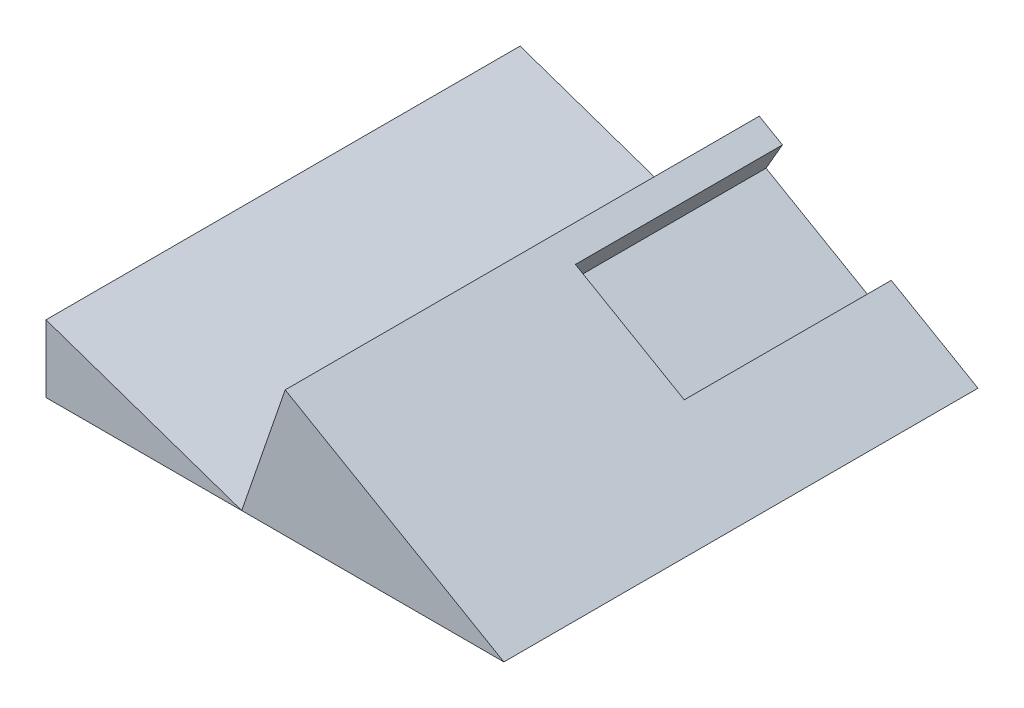
ISO-10303-21;
HEADER;
FILE_DESCRIPTION(('STEP AP214'),'2;1');
FILE_NAME('part.step','',(''),(''),'','','');
FILE_SCHEMA(('AUTOMOTIVE_DESIGN { 1 0 10303 214 1 1 1 1 }'));
ENDSEC;
DATA;
#1=APPLICATION_CONTEXT('core data for automotive mechanical design processes');
#2=APPLICATION_PROTOCOL_DEFINITION('international standard','automotive_design',2000,#1);
#3=PRODUCT_CONTEXT('',#1,'mechanical');
#4=PRODUCT('Part','Part','',(#3));
#5=PRODUCT_RELATED_PRODUCT_CATEGORY('part','',(#4));
#6=PRODUCT_DEFINITION_FORMATION('','',#4);
#7=PRODUCT_DEFINITION_CONTEXT('part definition',#1,'design');
#8=PRODUCT_DEFINITION('design','',#6,#7);
#9=PRODUCT_DEFINITION_SHAPE('','',#8);
#10=(LENGTH_UNIT() NAMED_UNIT(*) SI_UNIT(.MILLI.,.METRE.));
#11=(NAMED_UNIT(*) PLANE_ANGLE_UNIT() SI_UNIT($,.RADIAN.));
#12=(NAMED_UNIT(*) SI_UNIT($,.STERADIAN.) SOLID_ANGLE_UNIT());
#13=UNCERTAINTY_MEASURE_WITH_UNIT(LENGTH_MEASURE(1.E-05),#10,'distance_accuracy_value','');
#14=(GEOMETRIC_REPRESENTATION_CONTEXT(3) GLOBAL_UNCERTAINTY_ASSIGNED_CONTEXT((#13)) GLOBAL_UNIT_ASSIGNED_CONTEXT((#10,
#11,#12)) REPRESENTATION_CONTEXT('',''));
#15=CARTESIAN_POINT('',(0.,0.,0.));
#16=DIRECTION('',(0.,0.,1.));
#17=DIRECTION('',(1.,0.,0.));
#18=AXIS2_PLACEMENT_3D('',#15,#16,#17);
#19=CARTESIAN_POINT('',(19.423515405221,0.,-19.5));
#20=DIRECTION('',(0.,0.,1.));
#21=DIRECTION('',(1.,0.,0.));
#22=AXIS2_PLACEMENT_3D('',#19,#20,#21);
#23=PLANE('',#22);
#24=DIRECTION('',(0.866025403784438,-0.500000000000001,0.));
#25=VECTOR('',#24,1.);
#26=CARTESIAN_POINT('',(4.61602540378445,7.9951905283833,-19.5));
#27=LINE('',#26,#25);
#28=CARTESIAN_POINT('',(2.00961894323343,9.50000000000002,-19.5));
#29=VERTEX_POINT('',#28);
#30=CARTESIAN_POINT('',(15.,2.,-19.5));
#31=VERTEX_POINT('',#30);
#32=EDGE_CURVE('E115',#29,#31,#27,.T.);
#33=ORIENTED_EDGE('',*,*,#32,.T.);
#34=DIRECTION('',(-1.,0.,0.));
#35=VECTOR('',#34,1.);
#36=CARTESIAN_POINT('',(-73.3630592995996,2.,-19.5));
#37=LINE('',#36,#35);
#38=CARTESIAN_POINT('',(-24.2640880698669,2.,-19.5));
#39=VERTEX_POINT('',#38);
#40=EDGE_CURVE('E109',#31,#39,#37,.T.);
#41=ORIENTED_EDGE('',*,*,#40,.T.);
#42=DIRECTION('',(0.325444401146469,0.945561178222973,0.));
#43=VECTOR('',#42,1.);
#44=CARTESIAN_POINT('',(-22.3096352157414,7.67855749559022,-19.5));
#45=LINE('',#44,#43);
#46=CARTESIAN_POINT('',(-17.7552000469375,20.9112235644595,-19.5));
#47=VERTEX_POINT('',#46);
#48=EDGE_CURVE('E114',#39,#47,#45,.T.);
#49=ORIENTED_EDGE('',*,*,#48,.T.);
#50=CARTESIAN_POINT('',(-14.2910984317997,18.9112235644595,-19.5));
#51=VERTEX_POINT('',#50);
#52=EDGE_CURVE('E124',#47,#51,#27,.T.);
#53=ORIENTED_EDGE('',*,*,#52,.T.);
#54=DIRECTION('',(0.500000000000001,0.866025403784438,0.));
#55=VECTOR('',#54,1.);
#56=CARTESIAN_POINT('',(-16.7392952317479,14.6708223200218,-19.5));
#57=LINE('',#56,#55);
#58=CARTESIAN_POINT('',(-16.7392952317479,14.6708223200218,-19.5));
#59=VERTEX_POINT('',#58);
#60=EDGE_CURVE('E156',#59,#51,#57,.T.);
#61=ORIENTED_EDGE('',*,*,#60,.F.);
#62=DIRECTION('',(-0.866025403784438,0.500000000000001,0.));
#63=VECTOR('',#62,1.);
#64=CARTESIAN_POINT('',(2.16782860383635,3.75478928394566,-19.5));
#65=LINE('',#64,#63);
#66=CARTESIAN_POINT('',(-0.438577856714673,5.25959875556237,-19.5));
#67=VERTEX_POINT('',#66);
#68=EDGE_CURVE('E151',#67,#59,#65,.T.);
#69=ORIENTED_EDGE('',*,*,#68,.F.);
#70=DIRECTION('',(-0.500000000000001,-0.866025403784438,0.));
#71=VECTOR('',#70,1.);
#72=CARTESIAN_POINT('',(-0.438577856714673,5.25959875556237,-19.5));
#73=LINE('',#72,#71);
#74=EDGE_CURVE('E119',#29,#67,#73,.T.);
#75=ORIENTED_EDGE('',*,*,#74,.F.);
#76=EDGE_LOOP('',(#33,#41,#49,#53,#61,#69,#75));
#77=FACE_BOUND('',#76,.T.);
#78=ADVANCED_FACE('F53',(#77),#23,.F.);
#79=CARTESIAN_POINT('',(15.,2.,51.5));
#80=DIRECTION('',(0.,0.,-1.));
#81=DIRECTION('',(-1.,0.,0.));
#82=AXIS2_PLACEMENT_3D('',#79,#80,#81);
#83=PLANE('',#82);
#84=DIRECTION('',(-0.325444401146469,-0.945561178222973,0.));
#85=VECTOR('',#84,1.);
#86=CARTESIAN_POINT('',(-22.3096352157414,7.67855749559022,51.5));
#87=LINE('',#86,#85);
#88=CARTESIAN_POINT('',(-17.7552000469375,20.9112235644595,51.5));
#89=VERTEX_POINT('',#88);
#90=CARTESIAN_POINT('',(-24.2640880698669,2.,51.5));
#91=VERTEX_POINT('',#90);
#92=EDGE_CURVE('E138',#89,#91,#87,.T.);
#93=ORIENTED_EDGE('',*,*,#92,.T.);
#94=DIRECTION('',(1.,0.,0.));
#95=VECTOR('',#94,1.);
#96=CARTESIAN_POINT('',(15.,2.,51.5));
#97=LINE('',#96,#95);
#98=CARTESIAN_POINT('',(15.,2.,51.5));
#99=VERTEX_POINT('',#98);
#100=EDGE_CURVE('E57',#91,#99,#97,.T.);
#101=ORIENTED_EDGE('',*,*,#100,.T.);
#102=DIRECTION('',(-0.866025403784438,0.500000000000001,0.));
#103=VECTOR('',#102,1.);
#104=CARTESIAN_POINT('',(4.61602540378445,7.9951905283833,51.5));
#105=LINE('',#104,#103);
#106=EDGE_CURVE('E129',#99,#89,#105,.T.);
#107=ORIENTED_EDGE('',*,*,#106,.T.);
#108=EDGE_LOOP('',(#93,#101,#107));
#109=FACE_BOUND('',#108,.T.);
#110=ADVANCED_FACE('F180',(#109),#83,.F.);
#111=CARTESIAN_POINT('',(4.61602540378445,7.9951905283833,-51.5));
#112=DIRECTION('',(0.500000000000001,0.866025403784438,0.));
#113=DIRECTION('',(-0.866025403784438,0.500000000000001,0.));
#114=AXIS2_PLACEMENT_3D('',#111,#112,#113);
#115=PLANE('',#114);
#116=ORIENTED_EDGE('',*,*,#52,.F.);
#117=DIRECTION('',(0.,0.,1.));
#118=VECTOR('',#117,1.);
#119=CARTESIAN_POINT('',(-17.7552000469375,20.9112235644595,-51.5));
#120=LINE('',#119,#118);
#121=EDGE_CURVE('E130',#47,#89,#120,.T.);
#122=ORIENTED_EDGE('',*,*,#121,.T.);
#123=ORIENTED_EDGE('',*,*,#106,.F.);
#124=DIRECTION('',(0.,0.,-1.));
#125=VECTOR('',#124,1.);
#126=CARTESIAN_POINT('',(15.,2.,51.5));
#127=LINE('',#126,#125);
#128=EDGE_CURVE('E112',#99,#31,#127,.T.);
#129=ORIENTED_EDGE('',*,*,#128,.T.);
#130=ORIENTED_EDGE('',*,*,#32,.F.);
#131=DIRECTION('',(0.,0.,-1.));
#132=VECTOR('',#131,1.);
#133=CARTESIAN_POINT('',(2.00961894323343,9.50000000000002,-58.5));
#134=LINE('',#133,#132);
#135=CARTESIAN_POINT('',(2.00961894323344,9.50000000000001,11.5));
#136=VERTEX_POINT('',#135);
#137=EDGE_CURVE('E145',#136,#29,#134,.T.);
#138=ORIENTED_EDGE('',*,*,#137,.F.);
#139=DIRECTION('',(0.866025403784438,-0.500000000000001,0.));
#140=VECTOR('',#139,1.);
#141=CARTESIAN_POINT('',(2.00961894323344,9.50000000000001,11.5));
#142=LINE('',#141,#140);
#143=CARTESIAN_POINT('',(-14.2910984317998,18.9112235644595,11.5));
#144=VERTEX_POINT('',#143);
#145=EDGE_CURVE('E63',#144,#136,#142,.T.);
#146=ORIENTED_EDGE('',*,*,#145,.F.);
#147=DIRECTION('',(0.,0.,1.));
#148=VECTOR('',#147,1.);
#149=CARTESIAN_POINT('',(-14.2910984317998,18.9112235644595,-51.5));
#150=LINE('',#149,#148);
#151=EDGE_CURVE('E135',#51,#144,#150,.T.);
#152=ORIENTED_EDGE('',*,*,#151,.F.);
#153=EDGE_LOOP('',(#116,#122,#123,#129,#130,#138,#146,#152));
#154=FACE_BOUND('',#153,.T.);
#155=ADVANCED_FACE('F127',(#154),#115,.T.);
#156=CARTESIAN_POINT('',(-22.3096352157414,7.67855749559022,-51.5));
#157=DIRECTION('',(-0.945561178222973,0.325444401146469,0.));
#158=DIRECTION('',(-0.325444401146469,-0.945561178222973,0.));
#159=AXIS2_PLACEMENT_3D('',#156,#157,#158);
#160=PLANE('',#159);
#161=ORIENTED_EDGE('',*,*,#48,.F.);
#162=DIRECTION('',(0.,0.,1.));
#163=VECTOR('',#162,1.);
#164=CARTESIAN_POINT('',(-24.2640880698669,2.,-51.5));
#165=LINE('',#164,#163);
#166=EDGE_CURVE('E106',#39,#91,#165,.T.);
#167=ORIENTED_EDGE('',*,*,#166,.T.);
#168=ORIENTED_EDGE('',*,*,#92,.F.);
#169=ORIENTED_EDGE('',*,*,#121,.F.);
#170=EDGE_LOOP('',(#161,#167,#168,#169));
#171=FACE_BOUND('',#170,.T.);
#172=ADVANCED_FACE('F178',(#171),#160,.T.);
#173=CARTESIAN_POINT('',(2.16782860383635,3.75478928394566,0.));
#174=DIRECTION('',(-0.500000000000001,-0.866025403784438,0.));
#175=DIRECTION('',(0.866025403784438,-0.500000000000001,0.));
#176=AXIS2_PLACEMENT_3D('',#173,#174,#175);
#177=PLANE('',#176);
#178=DIRECTION('',(0.,0.,-1.));
#179=VECTOR('',#178,1.);
#180=CARTESIAN_POINT('',(-0.438577856714677,5.25959875556237,-58.5));
#181=LINE('',#180,#179);
#182=CARTESIAN_POINT('',(-0.438577856714669,5.25959875556237,11.5));
#183=VERTEX_POINT('',#182);
#184=EDGE_CURVE('E132',#183,#67,#181,.T.);
#185=ORIENTED_EDGE('',*,*,#184,.T.);
#186=ORIENTED_EDGE('',*,*,#68,.T.);
#187=DIRECTION('',(0.,0.,1.));
#188=VECTOR('',#187,1.);
#189=CARTESIAN_POINT('',(-16.7392952317479,14.6708223200218,11.5));
#190=LINE('',#189,#188);
#191=CARTESIAN_POINT('',(-16.7392952317479,14.6708223200218,11.5));
#192=VERTEX_POINT('',#191);
#193=EDGE_CURVE('E148',#59,#192,#190,.T.);
#194=ORIENTED_EDGE('',*,*,#193,.T.);
#195=DIRECTION('',(0.866025403784438,-0.500000000000001,0.));
#196=VECTOR('',#195,1.);
#197=CARTESIAN_POINT('',(-0.438577856714669,5.25959875556237,11.5));
#198=LINE('',#197,#196);
#199=EDGE_CURVE('E150',#192,#183,#198,.T.);
#200=ORIENTED_EDGE('',*,*,#199,.T.);
#201=EDGE_LOOP('',(#185,#186,#194,#200));
#202=FACE_BOUND('',#201,.T.);
#203=ADVANCED_FACE('F163',(#202),#177,.F.);
#204=CARTESIAN_POINT('',(-16.7392952317479,14.6708223200218,11.5));
#205=DIRECTION('',(-0.866025403784438,0.500000000000001,0.));
#206=DIRECTION('',(-0.500000000000001,-0.866025403784438,0.));
#207=AXIS2_PLACEMENT_3D('',#204,#205,#206);
#208=PLANE('',#207);
#209=ORIENTED_EDGE('',*,*,#193,.F.);
#210=ORIENTED_EDGE('',*,*,#60,.T.);
#211=ORIENTED_EDGE('',*,*,#151,.T.);
#212=DIRECTION('',(0.500000000000001,0.866025403784438,0.));
#213=VECTOR('',#212,1.);
#214=CARTESIAN_POINT('',(-16.7392952317479,14.6708223200218,11.5));
#215=LINE('',#214,#213);
#216=EDGE_CURVE('E12',#192,#144,#215,.T.);
#217=ORIENTED_EDGE('',*,*,#216,.F.);
#218=EDGE_LOOP('',(#209,#210,#211,#217));
#219=FACE_BOUND('',#218,.T.);
#220=ADVANCED_FACE('F167',(#219),#208,.F.);
#221=CARTESIAN_POINT('',(-0.438577856714677,5.25959875556237,-58.5));
#222=DIRECTION('',(0.866025403784438,-0.500000000000001,0.));
#223=DIRECTION('',(0.500000000000001,0.866025403784438,0.));
#224=AXIS2_PLACEMENT_3D('',#221,#222,#223);
#225=PLANE('',#224);
#226=ORIENTED_EDGE('',*,*,#137,.T.);
#227=ORIENTED_EDGE('',*,*,#74,.T.);
#228=ORIENTED_EDGE('',*,*,#184,.F.);
#229=DIRECTION('',(0.500000000000001,0.866025403784438,0.));
#230=VECTOR('',#229,1.);
#231=CARTESIAN_POINT('',(-0.438577856714669,5.25959875556237,11.5));
#232=LINE('',#231,#230);
#233=EDGE_CURVE('E142',#183,#136,#232,.T.);
#234=ORIENTED_EDGE('',*,*,#233,.T.);
#235=EDGE_LOOP('',(#226,#227,#228,#234));
#236=FACE_BOUND('',#235,.T.);
#237=ADVANCED_FACE('F174',(#236),#225,.F.);
#238=CARTESIAN_POINT('',(-0.438577856714669,5.25959875556237,11.5));
#239=DIRECTION('',(0.,0.,1.));
#240=DIRECTION('',(1.,0.,0.));
#241=AXIS2_PLACEMENT_3D('',#238,#239,#240);
#242=PLANE('',#241);
#243=ORIENTED_EDGE('',*,*,#145,.T.);
#244=ORIENTED_EDGE('',*,*,#233,.F.);
#245=ORIENTED_EDGE('',*,*,#199,.F.);
#246=ORIENTED_EDGE('',*,*,#216,.T.);
#247=EDGE_LOOP('',(#243,#244,#245,#246));
#248=FACE_BOUND('',#247,.T.);
#249=ADVANCED_FACE('F172',(#248),#242,.F.);
#250=CARTESIAN_POINT('',(-73.3630592995996,2.,-19.5));
#251=DIRECTION('',(0.,1.,0.));
#252=DIRECTION('',(0.,0.,1.));
#253=AXIS2_PLACEMENT_3D('',#250,#251,#252);
#254=PLANE('',#253);
#255=ORIENTED_EDGE('',*,*,#166,.F.);
#256=ORIENTED_EDGE('',*,*,#40,.F.);
#257=ORIENTED_EDGE('',*,*,#128,.F.);
#258=ORIENTED_EDGE('',*,*,#100,.F.);
#259=EDGE_LOOP('',(#255,#256,#257,#258));
#260=FACE_BOUND('',#259,.T.);
#261=ADVANCED_FACE('F55',(#260),#254,.F.);
#262=CLOSED_SHELL('',(#78,#110,#155,#172,#203,#220,#237,#249,#261));
#263=MANIFOLD_SOLID_BREP('B2',#262);
#264=CARTESIAN_POINT('',(19.423515405221,0.,-19.5));
#265=DIRECTION('',(0.,0.,1.));
#266=DIRECTION('',(1.,0.,0.));
#267=AXIS2_PLACEMENT_3D('',#264,#265,#266);
#268=PLANE('',#267);
#269=DIRECTION('',(0.945561178222972,-0.325444401146469,0.));
#270=VECTOR('',#269,1.);
#271=CARTESIAN_POINT('',(-1.9544528541255,-5.67855749559023,-19.5));
#272=LINE('',#271,#270);
#273=CARTESIAN_POINT('',(-53.576484594779,12.0887764355406,-19.5));
#274=VERTEX_POINT('',#273);
#275=CARTESIAN_POINT('',(-24.2640880698669,2.,-19.5));
#276=VERTEX_POINT('',#275);
#277=EDGE_CURVE('E310',#274,#276,#272,.T.);
#278=ORIENTED_EDGE('',*,*,#277,.T.);
#279=DIRECTION('',(-1.,0.,0.));
#280=VECTOR('',#279,1.);
#281=CARTESIAN_POINT('',(19.423515405221,2.,-19.5));
#282=LINE('',#281,#280);
#283=CARTESIAN_POINT('',(-53.576484594779,2.,-19.5));
#284=VERTEX_POINT('',#283);
#285=EDGE_CURVE('E279',#276,#284,#282,.T.);
#286=ORIENTED_EDGE('',*,*,#285,.T.);
#287=DIRECTION('',(0.,1.,0.));
#288=VECTOR('',#287,1.);
#289=CARTESIAN_POINT('',(-53.576484594779,0.,-19.5));
#290=LINE('',#289,#288);
#291=EDGE_CURVE('E311',#284,#274,#290,.T.);
#292=ORIENTED_EDGE('',*,*,#291,.T.);
#293=EDGE_LOOP('',(#278,#286,#292));
#294=FACE_BOUND('',#293,.T.);
#295=ADVANCED_FACE('F275',(#294),#268,.F.);
#296=CARTESIAN_POINT('',(-1.9544528541255,-5.67855749559023,-51.5));
#297=DIRECTION('',(0.325444401146469,0.945561178222972,0.));
#298=DIRECTION('',(-0.945561178222972,0.325444401146469,0.));
#299=AXIS2_PLACEMENT_3D('',#296,#297,#298);
#300=PLANE('',#299);
#301=ORIENTED_EDGE('',*,*,#277,.F.);
#302=DIRECTION('',(0.,0.,1.));
#303=VECTOR('',#302,1.);
#304=CARTESIAN_POINT('',(-53.576484594779,12.0887764355406,-51.5));
#305=LINE('',#304,#303);
#306=CARTESIAN_POINT('',(-53.576484594779,12.0887764355406,51.5));
#307=VERTEX_POINT('',#306);
#308=EDGE_CURVE('E308',#274,#307,#305,.T.);
#309=ORIENTED_EDGE('',*,*,#308,.T.);
#310=DIRECTION('',(-0.945561178222972,0.325444401146469,0.));
#311=VECTOR('',#310,1.);
#312=CARTESIAN_POINT('',(-1.9544528541255,-5.67855749559023,51.5));
#313=LINE('',#312,#311);
#314=CARTESIAN_POINT('',(-24.2640880698669,2.,51.5));
#315=VERTEX_POINT('',#314);
#316=EDGE_CURVE('E314',#315,#307,#313,.T.);
#317=ORIENTED_EDGE('',*,*,#316,.F.);
#318=DIRECTION('',(0.,0.,1.));
#319=VECTOR('',#318,1.);
#320=CARTESIAN_POINT('',(-24.2640880698669,2.,-51.5));
#321=LINE('',#320,#319);
#322=EDGE_CURVE('E51',#276,#315,#321,.T.);
#323=ORIENTED_EDGE('',*,*,#322,.F.);
#324=EDGE_LOOP('',(#301,#309,#317,#323));
#325=FACE_BOUND('',#324,.T.);
#326=ADVANCED_FACE('F316',(#325),#300,.T.);
#327=CARTESIAN_POINT('',(-53.576484594779,0.,-51.5));
#328=DIRECTION('',(-1.,0.,0.));
#329=DIRECTION('',(0.,0.,1.));
#330=AXIS2_PLACEMENT_3D('',#327,#328,#329);
#331=PLANE('',#330);
#332=DIRECTION('',(0.,0.,-1.));
#333=VECTOR('',#332,1.);
#334=CARTESIAN_POINT('',(-53.576484594779,2.,-51.5));
#335=LINE('',#334,#333);
#336=CARTESIAN_POINT('',(-53.576484594779,2.,51.5));
#337=VERTEX_POINT('',#336);
#338=EDGE_CURVE('E293',#337,#284,#335,.T.);
#339=ORIENTED_EDGE('',*,*,#338,.F.);
#340=DIRECTION('',(0.,-1.,0.));
#341=VECTOR('',#340,1.);
#342=CARTESIAN_POINT('',(-53.576484594779,0.,51.5));
#343=LINE('',#342,#341);
#344=EDGE_CURVE('E322',#307,#337,#343,.T.);
#345=ORIENTED_EDGE('',*,*,#344,.F.);
#346=ORIENTED_EDGE('',*,*,#308,.F.);
#347=ORIENTED_EDGE('',*,*,#291,.F.);
#348=EDGE_LOOP('',(#339,#345,#346,#347));
#349=FACE_BOUND('',#348,.T.);
#350=ADVANCED_FACE('F331',(#349),#331,.T.);
#351=CARTESIAN_POINT('',(15.,2.,51.5));
#352=DIRECTION('',(0.,0.,-1.));
#353=DIRECTION('',(-1.,0.,0.));
#354=AXIS2_PLACEMENT_3D('',#351,#352,#353);
#355=PLANE('',#354);
#356=ORIENTED_EDGE('',*,*,#344,.T.);
#357=DIRECTION('',(1.,0.,0.));
#358=VECTOR('',#357,1.);
#359=CARTESIAN_POINT('',(15.,2.,51.5));
#360=LINE('',#359,#358);
#361=EDGE_CURVE('E324',#337,#315,#360,.T.);
#362=ORIENTED_EDGE('',*,*,#361,.T.);
#363=ORIENTED_EDGE('',*,*,#316,.T.);
#364=EDGE_LOOP('',(#356,#362,#363));
#365=FACE_BOUND('',#364,.T.);
#366=ADVANCED_FACE('F277',(#365),#355,.F.);
#367=CARTESIAN_POINT('',(-73.3630592995996,2.,-19.5));
#368=DIRECTION('',(0.,1.,0.));
#369=DIRECTION('',(0.,0.,1.));
#370=AXIS2_PLACEMENT_3D('',#367,#368,#369);
#371=PLANE('',#370);
#372=ORIENTED_EDGE('',*,*,#338,.T.);
#373=ORIENTED_EDGE('',*,*,#285,.F.);
#374=ORIENTED_EDGE('',*,*,#322,.T.);
#375=ORIENTED_EDGE('',*,*,#361,.F.);
#376=EDGE_LOOP('',(#372,#373,#374,#375));
#377=FACE_BOUND('',#376,.T.);
#378=ADVANCED_FACE('F305',(#377),#371,.F.);
#379=CLOSED_SHELL('',(#295,#326,#350,#366,#378));
#380=MANIFOLD_SOLID_BREP('B6',#379);
#381=ADVANCED_BREP_SHAPE_REPRESENTATION('',(#18,#263,#380),#14);
#382=SHAPE_DEFINITION_REPRESENTATION(#9,#381);
ENDSEC;
END-ISO-10303-21;
